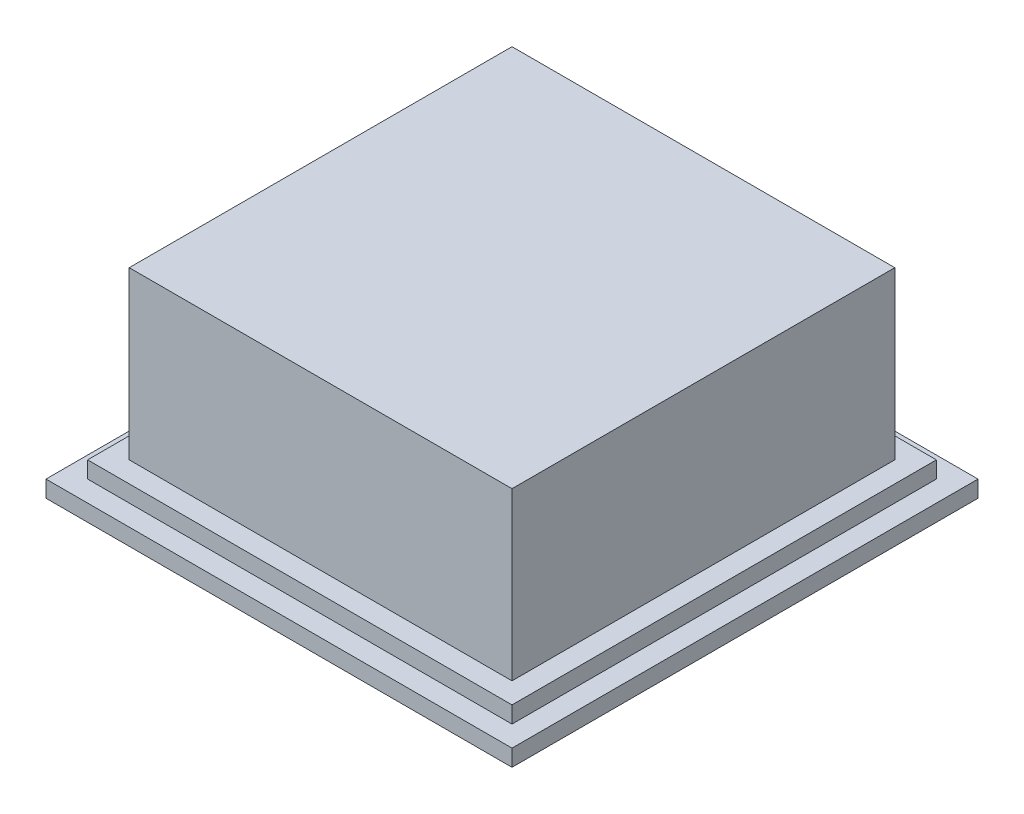
ISO-10303-21;
HEADER;
FILE_DESCRIPTION(('STEP AP214'),'2;1');
FILE_NAME('part.step','',(''),(''),'','','');
FILE_SCHEMA(('AUTOMOTIVE_DESIGN { 1 0 10303 214 1 1 1 1 }'));
ENDSEC;
DATA;
#1=APPLICATION_CONTEXT('core data for automotive mechanical design processes');
#2=APPLICATION_PROTOCOL_DEFINITION('international standard','automotive_design',2000,#1);
#3=PRODUCT_CONTEXT('',#1,'mechanical');
#4=PRODUCT('Part','Part','',(#3));
#5=PRODUCT_RELATED_PRODUCT_CATEGORY('part','',(#4));
#6=PRODUCT_DEFINITION_FORMATION('','',#4);
#7=PRODUCT_DEFINITION_CONTEXT('part definition',#1,'design');
#8=PRODUCT_DEFINITION('design','',#6,#7);
#9=PRODUCT_DEFINITION_SHAPE('','',#8);
#10=(LENGTH_UNIT() NAMED_UNIT(*) SI_UNIT(.MILLI.,.METRE.));
#11=(NAMED_UNIT(*) PLANE_ANGLE_UNIT() SI_UNIT($,.RADIAN.));
#12=(NAMED_UNIT(*) SI_UNIT($,.STERADIAN.) SOLID_ANGLE_UNIT());
#13=UNCERTAINTY_MEASURE_WITH_UNIT(LENGTH_MEASURE(1.E-05),#10,'distance_accuracy_value','');
#14=(GEOMETRIC_REPRESENTATION_CONTEXT(3) GLOBAL_UNCERTAINTY_ASSIGNED_CONTEXT((#13)) GLOBAL_UNIT_ASSIGNED_CONTEXT((#10,
#11,#12)) REPRESENTATION_CONTEXT('',''));
#15=CARTESIAN_POINT('',(0.,0.,0.));
#16=DIRECTION('',(0.,0.,1.));
#17=DIRECTION('',(1.,0.,0.));
#18=AXIS2_PLACEMENT_3D('',#15,#16,#17);
#19=CARTESIAN_POINT('',(0.,2.,0.));
#20=DIRECTION('',(0.,1.,0.));
#21=DIRECTION('',(0.,0.,1.));
#22=AXIS2_PLACEMENT_3D('',#19,#20,#21);
#23=PLANE('',#22);
#24=DIRECTION('',(0.,0.,1.));
#25=VECTOR('',#24,1.);
#26=CARTESIAN_POINT('',(-12.75,2.,12.75));
#27=LINE('',#26,#25);
#28=CARTESIAN_POINT('',(-12.75,2.,-12.75));
#29=VERTEX_POINT('',#28);
#30=CARTESIAN_POINT('',(-12.75,2.,12.75));
#31=VERTEX_POINT('',#30);
#32=EDGE_CURVE('E156',#29,#31,#27,.T.);
#33=ORIENTED_EDGE('',*,*,#32,.T.);
#34=DIRECTION('',(1.,0.,0.));
#35=VECTOR('',#34,1.);
#36=CARTESIAN_POINT('',(12.75,2.,12.75));
#37=LINE('',#36,#35);
#38=CARTESIAN_POINT('',(12.75,2.,12.75));
#39=VERTEX_POINT('',#38);
#40=EDGE_CURVE('E159',#31,#39,#37,.T.);
#41=ORIENTED_EDGE('',*,*,#40,.T.);
#42=DIRECTION('',(0.,0.,-1.));
#43=VECTOR('',#42,1.);
#44=CARTESIAN_POINT('',(12.75,2.,12.75));
#45=LINE('',#44,#43);
#46=CARTESIAN_POINT('',(12.75,2.,-12.75));
#47=VERTEX_POINT('',#46);
#48=EDGE_CURVE('E162',#39,#47,#45,.T.);
#49=ORIENTED_EDGE('',*,*,#48,.T.);
#50=DIRECTION('',(-1.,0.,0.));
#51=VECTOR('',#50,1.);
#52=CARTESIAN_POINT('',(12.75,2.,-12.75));
#53=LINE('',#52,#51);
#54=EDGE_CURVE('E164',#47,#29,#53,.T.);
#55=ORIENTED_EDGE('',*,*,#54,.T.);
#56=EDGE_LOOP('',(#33,#41,#49,#55));
#57=FACE_BOUND('',#56,.T.);
#58=DIRECTION('',(1.,0.,0.));
#59=VECTOR('',#58,1.);
#60=CARTESIAN_POINT('',(11.5,2.,11.5));
#61=LINE('',#60,#59);
#62=CARTESIAN_POINT('',(-11.5,2.,11.5));
#63=VERTEX_POINT('',#62);
#64=CARTESIAN_POINT('',(11.5,2.,11.5));
#65=VERTEX_POINT('',#64);
#66=EDGE_CURVE('E369',#63,#65,#61,.T.);
#67=ORIENTED_EDGE('',*,*,#66,.F.);
#68=DIRECTION('',(0.,0.,1.));
#69=VECTOR('',#68,1.);
#70=CARTESIAN_POINT('',(-11.5,2.,11.5));
#71=LINE('',#70,#69);
#72=CARTESIAN_POINT('',(-11.5,2.,-11.5));
#73=VERTEX_POINT('',#72);
#74=EDGE_CURVE('E146',#73,#63,#71,.T.);
#75=ORIENTED_EDGE('',*,*,#74,.F.);
#76=DIRECTION('',(-1.,0.,0.));
#77=VECTOR('',#76,1.);
#78=CARTESIAN_POINT('',(11.5,2.,-11.5));
#79=LINE('',#78,#77);
#80=CARTESIAN_POINT('',(11.5,2.,-11.5));
#81=VERTEX_POINT('',#80);
#82=EDGE_CURVE('E142',#81,#73,#79,.T.);
#83=ORIENTED_EDGE('',*,*,#82,.F.);
#84=DIRECTION('',(0.,0.,-1.));
#85=VECTOR('',#84,1.);
#86=CARTESIAN_POINT('',(11.5,2.,11.5));
#87=LINE('',#86,#85);
#88=EDGE_CURVE('E366',#65,#81,#87,.T.);
#89=ORIENTED_EDGE('',*,*,#88,.F.);
#90=EDGE_LOOP('',(#67,#75,#83,#89));
#91=FACE_BOUND('',#90,.T.);
#92=ADVANCED_FACE('F33',(#57,#91),#23,.T.);
#93=CARTESIAN_POINT('',(0.,1.,0.));
#94=DIRECTION('',(0.,1.,0.));
#95=DIRECTION('',(0.,0.,1.));
#96=AXIS2_PLACEMENT_3D('',#93,#94,#95);
#97=PLANE('',#96);
#98=DIRECTION('',(0.,0.,1.));
#99=VECTOR('',#98,1.);
#100=CARTESIAN_POINT('',(-14.,1.,14.));
#101=LINE('',#100,#99);
#102=CARTESIAN_POINT('',(-14.,1.,-14.));
#103=VERTEX_POINT('',#102);
#104=CARTESIAN_POINT('',(-14.,1.,14.));
#105=VERTEX_POINT('',#104);
#106=EDGE_CURVE('E180',#103,#105,#101,.T.);
#107=ORIENTED_EDGE('',*,*,#106,.T.);
#108=DIRECTION('',(1.,0.,0.));
#109=VECTOR('',#108,1.);
#110=CARTESIAN_POINT('',(14.,1.,14.));
#111=LINE('',#110,#109);
#112=CARTESIAN_POINT('',(14.,1.,14.));
#113=VERTEX_POINT('',#112);
#114=EDGE_CURVE('E183',#105,#113,#111,.T.);
#115=ORIENTED_EDGE('',*,*,#114,.T.);
#116=DIRECTION('',(0.,0.,-1.));
#117=VECTOR('',#116,1.);
#118=CARTESIAN_POINT('',(14.,1.,14.));
#119=LINE('',#118,#117);
#120=CARTESIAN_POINT('',(14.,1.,-14.));
#121=VERTEX_POINT('',#120);
#122=EDGE_CURVE('E186',#113,#121,#119,.T.);
#123=ORIENTED_EDGE('',*,*,#122,.T.);
#124=DIRECTION('',(-1.,0.,0.));
#125=VECTOR('',#124,1.);
#126=CARTESIAN_POINT('',(14.,1.,-14.));
#127=LINE('',#126,#125);
#128=EDGE_CURVE('E188',#121,#103,#127,.T.);
#129=ORIENTED_EDGE('',*,*,#128,.T.);
#130=EDGE_LOOP('',(#107,#115,#123,#129));
#131=FACE_BOUND('',#130,.T.);
#132=DIRECTION('',(1.,0.,0.));
#133=VECTOR('',#132,1.);
#134=CARTESIAN_POINT('',(12.75,1.,12.75));
#135=LINE('',#134,#133);
#136=CARTESIAN_POINT('',(-12.75,1.,12.75));
#137=VERTEX_POINT('',#136);
#138=CARTESIAN_POINT('',(12.75,1.,12.75));
#139=VERTEX_POINT('',#138);
#140=EDGE_CURVE('E151',#137,#139,#135,.T.);
#141=ORIENTED_EDGE('',*,*,#140,.F.);
#142=DIRECTION('',(0.,0.,1.));
#143=VECTOR('',#142,1.);
#144=CARTESIAN_POINT('',(-12.75,1.,12.75));
#145=LINE('',#144,#143);
#146=CARTESIAN_POINT('',(-12.75,1.,-12.75));
#147=VERTEX_POINT('',#146);
#148=EDGE_CURVE('E148',#147,#137,#145,.T.);
#149=ORIENTED_EDGE('',*,*,#148,.F.);
#150=DIRECTION('',(-1.,0.,0.));
#151=VECTOR('',#150,1.);
#152=CARTESIAN_POINT('',(12.75,1.,-12.75));
#153=LINE('',#152,#151);
#154=CARTESIAN_POINT('',(12.75,1.,-12.75));
#155=VERTEX_POINT('',#154);
#156=EDGE_CURVE('E160',#155,#147,#153,.T.);
#157=ORIENTED_EDGE('',*,*,#156,.F.);
#158=DIRECTION('',(0.,0.,-1.));
#159=VECTOR('',#158,1.);
#160=CARTESIAN_POINT('',(12.75,1.,12.75));
#161=LINE('',#160,#159);
#162=EDGE_CURVE('E168',#139,#155,#161,.T.);
#163=ORIENTED_EDGE('',*,*,#162,.F.);
#164=EDGE_LOOP('',(#141,#149,#157,#163));
#165=FACE_BOUND('',#164,.T.);
#166=ADVANCED_FACE('F222',(#131,#165),#97,.T.);
#167=CARTESIAN_POINT('',(-14.,1.,14.));
#168=DIRECTION('',(1.,0.,0.));
#169=DIRECTION('',(0.,0.,-1.));
#170=AXIS2_PLACEMENT_3D('',#167,#168,#169);
#171=PLANE('',#170);
#172=DIRECTION('',(0.,0.,1.));
#173=VECTOR('',#172,1.);
#174=CARTESIAN_POINT('',(-14.,0.,14.));
#175=LINE('',#174,#173);
#176=CARTESIAN_POINT('',(-14.,0.,-14.));
#177=VERTEX_POINT('',#176);
#178=CARTESIAN_POINT('',(-14.,0.,14.));
#179=VERTEX_POINT('',#178);
#180=EDGE_CURVE('E179',#177,#179,#175,.T.);
#181=ORIENTED_EDGE('',*,*,#180,.T.);
#182=DIRECTION('',(0.,-1.,0.));
#183=VECTOR('',#182,1.);
#184=CARTESIAN_POINT('',(-14.,1.,14.));
#185=LINE('',#184,#183);
#186=EDGE_CURVE('E11',#105,#179,#185,.T.);
#187=ORIENTED_EDGE('',*,*,#186,.F.);
#188=ORIENTED_EDGE('',*,*,#106,.F.);
#189=DIRECTION('',(0.,-1.,0.));
#190=VECTOR('',#189,1.);
#191=CARTESIAN_POINT('',(-14.,1.,-14.));
#192=LINE('',#191,#190);
#193=EDGE_CURVE('E190',#103,#177,#192,.T.);
#194=ORIENTED_EDGE('',*,*,#193,.T.);
#195=EDGE_LOOP('',(#181,#187,#188,#194));
#196=FACE_BOUND('',#195,.T.);
#197=ADVANCED_FACE('F35',(#196),#171,.F.);
#198=CARTESIAN_POINT('',(14.,1.,14.));
#199=DIRECTION('',(0.,0.,-1.));
#200=DIRECTION('',(-1.,0.,0.));
#201=AXIS2_PLACEMENT_3D('',#198,#199,#200);
#202=PLANE('',#201);
#203=DIRECTION('',(1.,0.,0.));
#204=VECTOR('',#203,1.);
#205=CARTESIAN_POINT('',(14.,0.,14.));
#206=LINE('',#205,#204);
#207=CARTESIAN_POINT('',(14.,0.,14.));
#208=VERTEX_POINT('',#207);
#209=EDGE_CURVE('E193',#179,#208,#206,.T.);
#210=ORIENTED_EDGE('',*,*,#209,.T.);
#211=DIRECTION('',(0.,-1.,0.));
#212=VECTOR('',#211,1.);
#213=CARTESIAN_POINT('',(14.,1.,14.));
#214=LINE('',#213,#212);
#215=EDGE_CURVE('E41',#113,#208,#214,.T.);
#216=ORIENTED_EDGE('',*,*,#215,.F.);
#217=ORIENTED_EDGE('',*,*,#114,.F.);
#218=ORIENTED_EDGE('',*,*,#186,.T.);
#219=EDGE_LOOP('',(#210,#216,#217,#218));
#220=FACE_BOUND('',#219,.T.);
#221=ADVANCED_FACE('F224',(#220),#202,.F.);
#222=CARTESIAN_POINT('',(14.,1.,14.));
#223=DIRECTION('',(-1.,0.,0.));
#224=DIRECTION('',(0.,0.,1.));
#225=AXIS2_PLACEMENT_3D('',#222,#223,#224);
#226=PLANE('',#225);
#227=DIRECTION('',(0.,0.,-1.));
#228=VECTOR('',#227,1.);
#229=CARTESIAN_POINT('',(14.,0.,14.));
#230=LINE('',#229,#228);
#231=CARTESIAN_POINT('',(14.,0.,-14.));
#232=VERTEX_POINT('',#231);
#233=EDGE_CURVE('E195',#208,#232,#230,.T.);
#234=ORIENTED_EDGE('',*,*,#233,.T.);
#235=DIRECTION('',(0.,-1.,0.));
#236=VECTOR('',#235,1.);
#237=CARTESIAN_POINT('',(14.,1.,-14.));
#238=LINE('',#237,#236);
#239=EDGE_CURVE('E200',#121,#232,#238,.T.);
#240=ORIENTED_EDGE('',*,*,#239,.F.);
#241=ORIENTED_EDGE('',*,*,#122,.F.);
#242=ORIENTED_EDGE('',*,*,#215,.T.);
#243=EDGE_LOOP('',(#234,#240,#241,#242));
#244=FACE_BOUND('',#243,.T.);
#245=ADVANCED_FACE('F207',(#244),#226,.F.);
#246=CARTESIAN_POINT('',(14.,1.,-14.));
#247=DIRECTION('',(0.,0.,1.));
#248=DIRECTION('',(1.,0.,0.));
#249=AXIS2_PLACEMENT_3D('',#246,#247,#248);
#250=PLANE('',#249);
#251=DIRECTION('',(-1.,0.,0.));
#252=VECTOR('',#251,1.);
#253=CARTESIAN_POINT('',(14.,0.,-14.));
#254=LINE('',#253,#252);
#255=EDGE_CURVE('E184',#232,#177,#254,.T.);
#256=ORIENTED_EDGE('',*,*,#255,.T.);
#257=ORIENTED_EDGE('',*,*,#193,.F.);
#258=ORIENTED_EDGE('',*,*,#128,.F.);
#259=ORIENTED_EDGE('',*,*,#239,.T.);
#260=EDGE_LOOP('',(#256,#257,#258,#259));
#261=FACE_BOUND('',#260,.T.);
#262=ADVANCED_FACE('F216',(#261),#250,.F.);
#263=CARTESIAN_POINT('',(0.,0.,0.));
#264=DIRECTION('',(0.,1.,0.));
#265=DIRECTION('',(0.,0.,1.));
#266=AXIS2_PLACEMENT_3D('',#263,#264,#265);
#267=PLANE('',#266);
#268=ORIENTED_EDGE('',*,*,#180,.F.);
#269=ORIENTED_EDGE('',*,*,#255,.F.);
#270=ORIENTED_EDGE('',*,*,#233,.F.);
#271=ORIENTED_EDGE('',*,*,#209,.F.);
#272=EDGE_LOOP('',(#268,#269,#270,#271));
#273=FACE_BOUND('',#272,.T.);
#274=ADVANCED_FACE('F213',(#273),#267,.F.);
#275=CARTESIAN_POINT('',(-12.75,2.,12.75));
#276=DIRECTION('',(1.,0.,0.));
#277=DIRECTION('',(0.,0.,-1.));
#278=AXIS2_PLACEMENT_3D('',#275,#276,#277);
#279=PLANE('',#278);
#280=ORIENTED_EDGE('',*,*,#148,.T.);
#281=DIRECTION('',(0.,-1.,0.));
#282=VECTOR('',#281,1.);
#283=CARTESIAN_POINT('',(-12.75,2.,12.75));
#284=LINE('',#283,#282);
#285=EDGE_CURVE('E177',#31,#137,#284,.T.);
#286=ORIENTED_EDGE('',*,*,#285,.F.);
#287=ORIENTED_EDGE('',*,*,#32,.F.);
#288=DIRECTION('',(0.,-1.,0.));
#289=VECTOR('',#288,1.);
#290=CARTESIAN_POINT('',(-12.75,2.,-12.75));
#291=LINE('',#290,#289);
#292=EDGE_CURVE('E165',#29,#147,#291,.T.);
#293=ORIENTED_EDGE('',*,*,#292,.T.);
#294=EDGE_LOOP('',(#280,#286,#287,#293));
#295=FACE_BOUND('',#294,.T.);
#296=ADVANCED_FACE('F252',(#295),#279,.F.);
#297=CARTESIAN_POINT('',(12.75,2.,12.75));
#298=DIRECTION('',(0.,0.,-1.));
#299=DIRECTION('',(-1.,0.,0.));
#300=AXIS2_PLACEMENT_3D('',#297,#298,#299);
#301=PLANE('',#300);
#302=ORIENTED_EDGE('',*,*,#140,.T.);
#303=DIRECTION('',(0.,-1.,0.));
#304=VECTOR('',#303,1.);
#305=CARTESIAN_POINT('',(12.75,2.,12.75));
#306=LINE('',#305,#304);
#307=EDGE_CURVE('E174',#39,#139,#306,.T.);
#308=ORIENTED_EDGE('',*,*,#307,.F.);
#309=ORIENTED_EDGE('',*,*,#40,.F.);
#310=ORIENTED_EDGE('',*,*,#285,.T.);
#311=EDGE_LOOP('',(#302,#308,#309,#310));
#312=FACE_BOUND('',#311,.T.);
#313=ADVANCED_FACE('F248',(#312),#301,.F.);
#314=CARTESIAN_POINT('',(12.75,2.,12.75));
#315=DIRECTION('',(-1.,0.,0.));
#316=DIRECTION('',(0.,0.,1.));
#317=AXIS2_PLACEMENT_3D('',#314,#315,#316);
#318=PLANE('',#317);
#319=ORIENTED_EDGE('',*,*,#162,.T.);
#320=DIRECTION('',(0.,-1.,0.));
#321=VECTOR('',#320,1.);
#322=CARTESIAN_POINT('',(12.75,2.,-12.75));
#323=LINE('',#322,#321);
#324=EDGE_CURVE('E56',#47,#155,#323,.T.);
#325=ORIENTED_EDGE('',*,*,#324,.F.);
#326=ORIENTED_EDGE('',*,*,#48,.F.);
#327=ORIENTED_EDGE('',*,*,#307,.T.);
#328=EDGE_LOOP('',(#319,#325,#326,#327));
#329=FACE_BOUND('',#328,.T.);
#330=ADVANCED_FACE('F245',(#329),#318,.F.);
#331=CARTESIAN_POINT('',(12.75,2.,-12.75));
#332=DIRECTION('',(0.,0.,1.));
#333=DIRECTION('',(1.,0.,0.));
#334=AXIS2_PLACEMENT_3D('',#331,#332,#333);
#335=PLANE('',#334);
#336=ORIENTED_EDGE('',*,*,#156,.T.);
#337=ORIENTED_EDGE('',*,*,#292,.F.);
#338=ORIENTED_EDGE('',*,*,#54,.F.);
#339=ORIENTED_EDGE('',*,*,#324,.T.);
#340=EDGE_LOOP('',(#336,#337,#338,#339));
#341=FACE_BOUND('',#340,.T.);
#342=ADVANCED_FACE('F242',(#341),#335,.F.);
#343=CARTESIAN_POINT('',(-11.5,12.,11.5));
#344=DIRECTION('',(1.,0.,0.));
#345=DIRECTION('',(0.,0.,-1.));
#346=AXIS2_PLACEMENT_3D('',#343,#344,#345);
#347=PLANE('',#346);
#348=ORIENTED_EDGE('',*,*,#74,.T.);
#349=DIRECTION('',(0.,-1.,0.));
#350=VECTOR('',#349,1.);
#351=CARTESIAN_POINT('',(-11.5,12.,11.5));
#352=LINE('',#351,#350);
#353=CARTESIAN_POINT('',(-11.5,12.,11.5));
#354=VERTEX_POINT('',#353);
#355=EDGE_CURVE('E127',#354,#63,#352,.T.);
#356=ORIENTED_EDGE('',*,*,#355,.F.);
#357=DIRECTION('',(0.,0.,1.));
#358=VECTOR('',#357,1.);
#359=CARTESIAN_POINT('',(-11.5,12.,11.5));
#360=LINE('',#359,#358);
#361=CARTESIAN_POINT('',(-11.5,12.,-11.5));
#362=VERTEX_POINT('',#361);
#363=EDGE_CURVE('E134',#362,#354,#360,.T.);
#364=ORIENTED_EDGE('',*,*,#363,.F.);
#365=DIRECTION('',(0.,-1.,0.));
#366=VECTOR('',#365,1.);
#367=CARTESIAN_POINT('',(-11.5,12.,-11.5));
#368=LINE('',#367,#366);
#369=EDGE_CURVE('E364',#362,#73,#368,.T.);
#370=ORIENTED_EDGE('',*,*,#369,.T.);
#371=EDGE_LOOP('',(#348,#356,#364,#370));
#372=FACE_BOUND('',#371,.T.);
#373=ADVANCED_FACE('F144',(#372),#347,.F.);
#374=CARTESIAN_POINT('',(11.5,12.,11.5));
#375=DIRECTION('',(0.,0.,-1.));
#376=DIRECTION('',(-1.,0.,0.));
#377=AXIS2_PLACEMENT_3D('',#374,#375,#376);
#378=PLANE('',#377);
#379=ORIENTED_EDGE('',*,*,#66,.T.);
#380=DIRECTION('',(0.,-1.,0.));
#381=VECTOR('',#380,1.);
#382=CARTESIAN_POINT('',(11.5,12.,11.5));
#383=LINE('',#382,#381);
#384=CARTESIAN_POINT('',(11.5,12.,11.5));
#385=VERTEX_POINT('',#384);
#386=EDGE_CURVE('E130',#385,#65,#383,.T.);
#387=ORIENTED_EDGE('',*,*,#386,.F.);
#388=DIRECTION('',(1.,0.,0.));
#389=VECTOR('',#388,1.);
#390=CARTESIAN_POINT('',(11.5,12.,11.5));
#391=LINE('',#390,#389);
#392=EDGE_CURVE('E123',#354,#385,#391,.T.);
#393=ORIENTED_EDGE('',*,*,#392,.F.);
#394=ORIENTED_EDGE('',*,*,#355,.T.);
#395=EDGE_LOOP('',(#379,#387,#393,#394));
#396=FACE_BOUND('',#395,.T.);
#397=ADVANCED_FACE('F125',(#396),#378,.F.);
#398=CARTESIAN_POINT('',(11.5,12.,11.5));
#399=DIRECTION('',(-1.,0.,0.));
#400=DIRECTION('',(0.,0.,1.));
#401=AXIS2_PLACEMENT_3D('',#398,#399,#400);
#402=PLANE('',#401);
#403=ORIENTED_EDGE('',*,*,#88,.T.);
#404=DIRECTION('',(0.,-1.,0.));
#405=VECTOR('',#404,1.);
#406=CARTESIAN_POINT('',(11.5,12.,-11.5));
#407=LINE('',#406,#405);
#408=CARTESIAN_POINT('',(11.5,12.,-11.5));
#409=VERTEX_POINT('',#408);
#410=EDGE_CURVE('E48',#409,#81,#407,.T.);
#411=ORIENTED_EDGE('',*,*,#410,.F.);
#412=DIRECTION('',(0.,0.,-1.));
#413=VECTOR('',#412,1.);
#414=CARTESIAN_POINT('',(11.5,12.,11.5));
#415=LINE('',#414,#413);
#416=EDGE_CURVE('E133',#385,#409,#415,.T.);
#417=ORIENTED_EDGE('',*,*,#416,.F.);
#418=ORIENTED_EDGE('',*,*,#386,.T.);
#419=EDGE_LOOP('',(#403,#411,#417,#418));
#420=FACE_BOUND('',#419,.T.);
#421=ADVANCED_FACE('F296',(#420),#402,.F.);
#422=CARTESIAN_POINT('',(11.5,12.,-11.5));
#423=DIRECTION('',(0.,0.,1.));
#424=DIRECTION('',(1.,0.,0.));
#425=AXIS2_PLACEMENT_3D('',#422,#423,#424);
#426=PLANE('',#425);
#427=ORIENTED_EDGE('',*,*,#82,.T.);
#428=ORIENTED_EDGE('',*,*,#369,.F.);
#429=DIRECTION('',(-1.,0.,0.));
#430=VECTOR('',#429,1.);
#431=CARTESIAN_POINT('',(11.5,12.,-11.5));
#432=LINE('',#431,#430);
#433=EDGE_CURVE('E138',#409,#362,#432,.T.);
#434=ORIENTED_EDGE('',*,*,#433,.F.);
#435=ORIENTED_EDGE('',*,*,#410,.T.);
#436=EDGE_LOOP('',(#427,#428,#434,#435));
#437=FACE_BOUND('',#436,.T.);
#438=ADVANCED_FACE('F302',(#437),#426,.F.);
#439=CARTESIAN_POINT('',(0.,12.,0.));
#440=DIRECTION('',(0.,1.,0.));
#441=DIRECTION('',(0.,0.,1.));
#442=AXIS2_PLACEMENT_3D('',#439,#440,#441);
#443=PLANE('',#442);
#444=ORIENTED_EDGE('',*,*,#363,.T.);
#445=ORIENTED_EDGE('',*,*,#392,.T.);
#446=ORIENTED_EDGE('',*,*,#416,.T.);
#447=ORIENTED_EDGE('',*,*,#433,.T.);
#448=EDGE_LOOP('',(#444,#445,#446,#447));
#449=FACE_BOUND('',#448,.T.);
#450=ADVANCED_FACE('F137',(#449),#443,.T.);
#451=CLOSED_SHELL('',(#92,#166,#197,#221,#245,#262,#274,#296,#313,#330,#342,#373,#397,#421,#438,#450));
#452=MANIFOLD_SOLID_BREP('B2',#451);
#453=ADVANCED_BREP_SHAPE_REPRESENTATION('',(#18,#452),#14);
#454=SHAPE_DEFINITION_REPRESENTATION(#9,#453);
ENDSEC;
END-ISO-10303-21;
